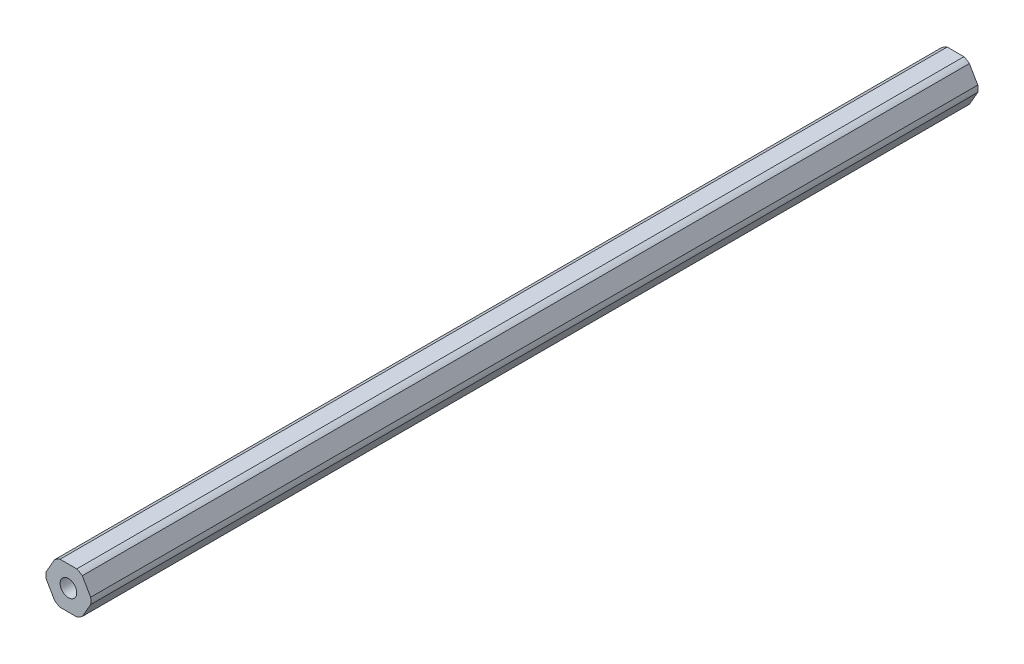
ISO-10303-21;
HEADER;
FILE_DESCRIPTION(('STEP AP214'),'2;1');
FILE_NAME('part.step','',(''),(''),'','','');
FILE_SCHEMA(('AUTOMOTIVE_DESIGN { 1 0 10303 214 1 1 1 1 }'));
ENDSEC;
DATA;
#1=APPLICATION_CONTEXT('core data for automotive mechanical design processes');
#2=APPLICATION_PROTOCOL_DEFINITION('international standard','automotive_design',2000,#1);
#3=PRODUCT_CONTEXT('',#1,'mechanical');
#4=PRODUCT('Part','Part','',(#3));
#5=PRODUCT_RELATED_PRODUCT_CATEGORY('part','',(#4));
#6=PRODUCT_DEFINITION_FORMATION('','',#4);
#7=PRODUCT_DEFINITION_CONTEXT('part definition',#1,'design');
#8=PRODUCT_DEFINITION('design','',#6,#7);
#9=PRODUCT_DEFINITION_SHAPE('','',#8);
#10=(LENGTH_UNIT() NAMED_UNIT(*) SI_UNIT(.MILLI.,.METRE.));
#11=(NAMED_UNIT(*) PLANE_ANGLE_UNIT() SI_UNIT($,.RADIAN.));
#12=(NAMED_UNIT(*) SI_UNIT($,.STERADIAN.) SOLID_ANGLE_UNIT());
#13=UNCERTAINTY_MEASURE_WITH_UNIT(LENGTH_MEASURE(1.E-05),#10,'distance_accuracy_value','');
#14=(GEOMETRIC_REPRESENTATION_CONTEXT(3) GLOBAL_UNCERTAINTY_ASSIGNED_CONTEXT((#13)) GLOBAL_UNIT_ASSIGNED_CONTEXT((#10,
#11,#12)) REPRESENTATION_CONTEXT('',''));
#15=CARTESIAN_POINT('',(0.,0.,0.));
#16=DIRECTION('',(0.,0.,1.));
#17=DIRECTION('',(1.,0.,0.));
#18=AXIS2_PLACEMENT_3D('',#15,#16,#17);
#19=CARTESIAN_POINT('',(3.68083890619154,-6.3754,228.6));
#20=DIRECTION('',(-0.866025403784439,0.5,0.));
#21=DIRECTION('',(0.,0.,1.));
#22=AXIS2_PLACEMENT_3D('',#19,#20,#21);
#23=PLANE('',#22);
#24=DIRECTION('',(0.,0.,-1.));
#25=VECTOR('',#24,1.);
#26=CARTESIAN_POINT('',(6.80102150534208,-0.971085209378962,-228.6));
#27=LINE('',#26,#25);
#28=CARTESIAN_POINT('',(6.80102150534208,-0.971085209378956,42.9133));
#29=VERTEX_POINT('',#28);
#30=CARTESIAN_POINT('',(6.80102150534208,-0.971085209378955,-228.6));
#31=VERTEX_POINT('',#30);
#32=EDGE_CURVE('E176',#29,#31,#27,.T.);
#33=ORIENTED_EDGE('',*,*,#32,.F.);
#34=DIRECTION('',(0.500000000000001,0.866025403784438,0.));
#35=VECTOR('',#34,1.);
#36=CARTESIAN_POINT('',(5.52125835928731,-3.18770000000001,42.9133));
#37=LINE('',#36,#35);
#38=CARTESIAN_POINT('',(4.24149521323254,-5.40431479062105,42.9133));
#39=VERTEX_POINT('',#38);
#40=EDGE_CURVE('E179',#39,#29,#37,.T.);
#41=ORIENTED_EDGE('',*,*,#40,.F.);
#42=DIRECTION('',(0.,0.,1.));
#43=VECTOR('',#42,1.);
#44=CARTESIAN_POINT('',(4.24149521323255,-5.40431479062104,-228.6));
#45=LINE('',#44,#43);
#46=CARTESIAN_POINT('',(4.24149521323254,-5.40431479062105,-228.6));
#47=VERTEX_POINT('',#46);
#48=EDGE_CURVE('E277',#47,#39,#45,.T.);
#49=ORIENTED_EDGE('',*,*,#48,.F.);
#50=DIRECTION('',(0.5,0.866025403784439,0.));
#51=VECTOR('',#50,1.);
#52=CARTESIAN_POINT('',(3.68083890619154,-6.3754,-228.6));
#53=LINE('',#52,#51);
#54=EDGE_CURVE('E181',#47,#31,#53,.T.);
#55=ORIENTED_EDGE('',*,*,#54,.T.);
#56=EDGE_LOOP('',(#33,#41,#49,#55));
#57=FACE_BOUND('',#56,.T.);
#58=ADVANCED_FACE('F45',(#57),#23,.F.);
#59=CARTESIAN_POINT('',(7.36167781238308,0.,228.6));
#60=DIRECTION('',(-0.866025403784439,-0.5,0.));
#61=DIRECTION('',(-0.5,0.866025403784439,0.));
#62=AXIS2_PLACEMENT_3D('',#59,#60,#61);
#63=PLANE('',#62);
#64=DIRECTION('',(0.,0.,-1.));
#65=VECTOR('',#64,1.);
#66=CARTESIAN_POINT('',(4.24149521323254,5.40431479062105,-228.6));
#67=LINE('',#66,#65);
#68=CARTESIAN_POINT('',(4.24149521323254,5.40431479062105,42.9133));
#69=VERTEX_POINT('',#68);
#70=CARTESIAN_POINT('',(4.24149521323254,5.40431479062105,-228.6));
#71=VERTEX_POINT('',#70);
#72=EDGE_CURVE('E263',#69,#71,#67,.T.);
#73=ORIENTED_EDGE('',*,*,#72,.F.);
#74=DIRECTION('',(-0.5,0.866025403784438,0.));
#75=VECTOR('',#74,1.);
#76=CARTESIAN_POINT('',(5.52125835928731,3.1877,42.9133));
#77=LINE('',#76,#75);
#78=CARTESIAN_POINT('',(6.80102150534208,0.97108520937895,42.9133));
#79=VERTEX_POINT('',#78);
#80=EDGE_CURVE('E197',#79,#69,#77,.T.);
#81=ORIENTED_EDGE('',*,*,#80,.F.);
#82=DIRECTION('',(0.,0.,1.));
#83=VECTOR('',#82,1.);
#84=CARTESIAN_POINT('',(6.80102150534208,0.971085209378949,-228.6));
#85=LINE('',#84,#83);
#86=CARTESIAN_POINT('',(6.80102150534208,0.97108520937895,-228.6));
#87=VERTEX_POINT('',#86);
#88=EDGE_CURVE('E192',#87,#79,#85,.T.);
#89=ORIENTED_EDGE('',*,*,#88,.F.);
#90=DIRECTION('',(-0.5,0.866025403784439,0.));
#91=VECTOR('',#90,1.);
#92=CARTESIAN_POINT('',(7.36167781238308,0.,-228.6));
#93=LINE('',#92,#91);
#94=EDGE_CURVE('E284',#87,#71,#93,.T.);
#95=ORIENTED_EDGE('',*,*,#94,.T.);
#96=EDGE_LOOP('',(#73,#81,#89,#95));
#97=FACE_BOUND('',#96,.T.);
#98=ADVANCED_FACE('F341',(#97),#63,.F.);
#99=CARTESIAN_POINT('',(3.68083890619154,6.3754,228.6));
#100=DIRECTION('',(0.,-1.,0.));
#101=DIRECTION('',(0.,0.,-1.));
#102=AXIS2_PLACEMENT_3D('',#99,#100,#101);
#103=PLANE('',#102);
#104=DIRECTION('',(0.,0.,-1.));
#105=VECTOR('',#104,1.);
#106=CARTESIAN_POINT('',(-2.55952629210953,6.3754,-228.6));
#107=LINE('',#106,#105);
#108=CARTESIAN_POINT('',(-2.55952629210953,6.3754,42.9133));
#109=VERTEX_POINT('',#108);
#110=CARTESIAN_POINT('',(-2.55952629210953,6.3754,-228.6));
#111=VERTEX_POINT('',#110);
#112=EDGE_CURVE('E104',#109,#111,#107,.T.);
#113=ORIENTED_EDGE('',*,*,#112,.F.);
#114=DIRECTION('',(-1.,0.,0.));
#115=VECTOR('',#114,1.);
#116=CARTESIAN_POINT('',(0.,6.3754,42.9133));
#117=LINE('',#116,#115);
#118=CARTESIAN_POINT('',(2.55952629210953,6.3754,42.9133));
#119=VERTEX_POINT('',#118);
#120=EDGE_CURVE('E217',#119,#109,#117,.T.);
#121=ORIENTED_EDGE('',*,*,#120,.F.);
#122=DIRECTION('',(0.,0.,1.));
#123=VECTOR('',#122,1.);
#124=CARTESIAN_POINT('',(2.55952629210952,6.3754,-228.6));
#125=LINE('',#124,#123);
#126=CARTESIAN_POINT('',(2.55952629210952,6.3754,-228.6));
#127=VERTEX_POINT('',#126);
#128=EDGE_CURVE('E90',#127,#119,#125,.T.);
#129=ORIENTED_EDGE('',*,*,#128,.F.);
#130=DIRECTION('',(-1.,0.,0.));
#131=VECTOR('',#130,1.);
#132=CARTESIAN_POINT('',(3.68083890619154,6.3754,-228.6));
#133=LINE('',#132,#131);
#134=EDGE_CURVE('E281',#127,#111,#133,.T.);
#135=ORIENTED_EDGE('',*,*,#134,.T.);
#136=EDGE_LOOP('',(#113,#121,#129,#135));
#137=FACE_BOUND('',#136,.T.);
#138=ADVANCED_FACE('F363',(#137),#103,.F.);
#139=CARTESIAN_POINT('',(-3.68083890619154,6.3754,228.6));
#140=DIRECTION('',(0.866025403784439,-0.5,0.));
#141=DIRECTION('',(0.,0.,-1.));
#142=AXIS2_PLACEMENT_3D('',#139,#140,#141);
#143=PLANE('',#142);
#144=DIRECTION('',(0.,0.,-1.));
#145=VECTOR('',#144,1.);
#146=CARTESIAN_POINT('',(-6.80102150534208,0.97108520937896,-228.6));
#147=LINE('',#146,#145);
#148=CARTESIAN_POINT('',(-6.80102150534208,0.971085209378959,42.9133));
#149=VERTEX_POINT('',#148);
#150=CARTESIAN_POINT('',(-6.80102150534208,0.97108520937896,-228.6));
#151=VERTEX_POINT('',#150);
#152=EDGE_CURVE('E257',#149,#151,#147,.T.);
#153=ORIENTED_EDGE('',*,*,#152,.F.);
#154=DIRECTION('',(-0.500000000000001,-0.866025403784438,0.));
#155=VECTOR('',#154,1.);
#156=CARTESIAN_POINT('',(-5.52125835928731,3.18770000000001,42.9133));
#157=LINE('',#156,#155);
#158=CARTESIAN_POINT('',(-4.24149521323255,5.40431479062104,42.9133));
#159=VERTEX_POINT('',#158);
#160=EDGE_CURVE('E225',#159,#149,#157,.T.);
#161=ORIENTED_EDGE('',*,*,#160,.F.);
#162=DIRECTION('',(0.,0.,1.));
#163=VECTOR('',#162,1.);
#164=CARTESIAN_POINT('',(-4.24149521323255,5.40431479062105,-228.6));
#165=LINE('',#164,#163);
#166=CARTESIAN_POINT('',(-4.24149521323255,5.40431479062105,-228.6));
#167=VERTEX_POINT('',#166);
#168=EDGE_CURVE('E264',#167,#159,#165,.T.);
#169=ORIENTED_EDGE('',*,*,#168,.F.);
#170=DIRECTION('',(-0.5,-0.866025403784439,0.));
#171=VECTOR('',#170,1.);
#172=CARTESIAN_POINT('',(-3.68083890619154,6.3754,-228.6));
#173=LINE('',#172,#171);
#174=EDGE_CURVE('E251',#167,#151,#173,.T.);
#175=ORIENTED_EDGE('',*,*,#174,.T.);
#176=EDGE_LOOP('',(#153,#161,#169,#175));
#177=FACE_BOUND('',#176,.T.);
#178=ADVANCED_FACE('F375',(#177),#143,.F.);
#179=CARTESIAN_POINT('',(-7.36167781238308,0.,228.6));
#180=DIRECTION('',(0.866025403784439,0.5,0.));
#181=DIRECTION('',(0.,0.,-1.));
#182=AXIS2_PLACEMENT_3D('',#179,#180,#181);
#183=PLANE('',#182);
#184=DIRECTION('',(0.,0.,-1.));
#185=VECTOR('',#184,1.);
#186=CARTESIAN_POINT('',(-4.24149521323255,-5.40431479062104,-228.6));
#187=LINE('',#186,#185);
#188=CARTESIAN_POINT('',(-4.24149521323255,-5.40431479062105,42.9133));
#189=VERTEX_POINT('',#188);
#190=CARTESIAN_POINT('',(-4.24149521323254,-5.40431479062105,-228.6));
#191=VERTEX_POINT('',#190);
#192=EDGE_CURVE('E273',#189,#191,#187,.T.);
#193=ORIENTED_EDGE('',*,*,#192,.F.);
#194=DIRECTION('',(0.5,-0.866025403784439,0.));
#195=VECTOR('',#194,1.);
#196=CARTESIAN_POINT('',(-5.52125835928731,-3.1877,42.9133));
#197=LINE('',#196,#195);
#198=CARTESIAN_POINT('',(-6.80102150534208,-0.971085209378948,42.9133));
#199=VERTEX_POINT('',#198);
#200=EDGE_CURVE('E233',#199,#189,#197,.T.);
#201=ORIENTED_EDGE('',*,*,#200,.F.);
#202=DIRECTION('',(0.,0.,1.));
#203=VECTOR('',#202,1.);
#204=CARTESIAN_POINT('',(-6.80102150534208,-0.971085209378962,-228.6));
#205=LINE('',#204,#203);
#206=CARTESIAN_POINT('',(-6.80102150534208,-0.971085209378956,-228.6));
#207=VERTEX_POINT('',#206);
#208=EDGE_CURVE('E258',#207,#199,#205,.T.);
#209=ORIENTED_EDGE('',*,*,#208,.F.);
#210=DIRECTION('',(0.5,-0.866025403784439,0.));
#211=VECTOR('',#210,1.);
#212=CARTESIAN_POINT('',(-7.36167781238308,0.,-228.6));
#213=LINE('',#212,#211);
#214=EDGE_CURVE('E247',#207,#191,#213,.T.);
#215=ORIENTED_EDGE('',*,*,#214,.T.);
#216=EDGE_LOOP('',(#193,#201,#209,#215));
#217=FACE_BOUND('',#216,.T.);
#218=ADVANCED_FACE('F373',(#217),#183,.F.);
#219=CARTESIAN_POINT('',(-3.68083890619154,-6.3754,228.6));
#220=DIRECTION('',(0.,1.,0.));
#221=DIRECTION('',(1.,0.,0.));
#222=AXIS2_PLACEMENT_3D('',#219,#220,#221);
#223=PLANE('',#222);
#224=DIRECTION('',(0.,0.,-1.));
#225=VECTOR('',#224,1.);
#226=CARTESIAN_POINT('',(2.55952629210953,-6.3754,-228.6));
#227=LINE('',#226,#225);
#228=CARTESIAN_POINT('',(2.55952629210953,-6.3754,42.9133));
#229=VERTEX_POINT('',#228);
#230=CARTESIAN_POINT('',(2.55952629210953,-6.3754,-228.6));
#231=VERTEX_POINT('',#230);
#232=EDGE_CURVE('E272',#229,#231,#227,.T.);
#233=ORIENTED_EDGE('',*,*,#232,.F.);
#234=DIRECTION('',(1.,0.,0.));
#235=VECTOR('',#234,1.);
#236=CARTESIAN_POINT('',(0.,-6.3754,42.9133));
#237=LINE('',#236,#235);
#238=CARTESIAN_POINT('',(-2.55952629210953,-6.3754,42.9133));
#239=VERTEX_POINT('',#238);
#240=EDGE_CURVE('E241',#239,#229,#237,.T.);
#241=ORIENTED_EDGE('',*,*,#240,.F.);
#242=DIRECTION('',(0.,0.,1.));
#243=VECTOR('',#242,1.);
#244=CARTESIAN_POINT('',(-2.55952629210953,-6.3754,-228.6));
#245=LINE('',#244,#243);
#246=CARTESIAN_POINT('',(-2.55952629210953,-6.3754,-228.6));
#247=VERTEX_POINT('',#246);
#248=EDGE_CURVE('E287',#247,#239,#245,.T.);
#249=ORIENTED_EDGE('',*,*,#248,.F.);
#250=DIRECTION('',(1.,0.,0.));
#251=VECTOR('',#250,1.);
#252=CARTESIAN_POINT('',(-3.68083890619154,-6.3754,-228.6));
#253=LINE('',#252,#251);
#254=EDGE_CURVE('E252',#247,#231,#253,.T.);
#255=ORIENTED_EDGE('',*,*,#254,.T.);
#256=EDGE_LOOP('',(#233,#241,#249,#255));
#257=FACE_BOUND('',#256,.T.);
#258=ADVANCED_FACE('F372',(#257),#223,.F.);
#259=CARTESIAN_POINT('',(0.,0.,-228.6));
#260=DIRECTION('',(0.,0.,1.));
#261=DIRECTION('',(1.,0.,0.));
#262=AXIS2_PLACEMENT_3D('',#259,#260,#261);
#263=CYLINDRICAL_SURFACE('',#262,6.87);
#264=ORIENTED_EDGE('',*,*,#88,.T.);
#265=CARTESIAN_POINT('',(0.,0.,42.9133));
#266=DIRECTION('',(0.,0.,1.));
#267=DIRECTION('',(1.,0.,0.));
#268=AXIS2_PLACEMENT_3D('',#265,#266,#267);
#269=CIRCLE('',#268,6.87);
#270=EDGE_CURVE('E189',#29,#79,#269,.T.);
#271=ORIENTED_EDGE('',*,*,#270,.F.);
#272=ORIENTED_EDGE('',*,*,#32,.T.);
#273=CARTESIAN_POINT('',(0.,0.,-228.6));
#274=DIRECTION('',(0.,0.,1.));
#275=DIRECTION('',(1.,0.,0.));
#276=AXIS2_PLACEMENT_3D('',#273,#274,#275);
#277=CIRCLE('',#276,6.87);
#278=CARTESIAN_POINT('',(6.87,0.,-228.6));
#279=VERTEX_POINT('',#278);
#280=EDGE_CURVE('E55',#31,#279,#277,.T.);
#281=ORIENTED_EDGE('',*,*,#280,.T.);
#282=DIRECTION('',(0.,0.,1.));
#283=VECTOR('',#282,1.);
#284=CARTESIAN_POINT('',(6.87,0.,-228.6));
#285=LINE('',#284,#283);
#286=CARTESIAN_POINT('',(6.87,0.,-144.04975));
#287=VERTEX_POINT('',#286);
#288=EDGE_CURVE('E186',#279,#287,#285,.T.);
#289=ORIENTED_EDGE('',*,*,#288,.T.);
#290=ORIENTED_EDGE('',*,*,#288,.F.);
#291=CARTESIAN_POINT('',(0.,0.,-228.6));
#292=DIRECTION('',(0.,0.,1.));
#293=DIRECTION('',(1.,0.,0.));
#294=AXIS2_PLACEMENT_3D('',#291,#292,#293);
#295=CIRCLE('',#294,6.87);
#296=EDGE_CURVE('E276',#279,#87,#295,.T.);
#297=ORIENTED_EDGE('',*,*,#296,.T.);
#298=EDGE_LOOP('',(#264,#271,#272,#281,#289,#290,#297));
#299=FACE_BOUND('',#298,.T.);
#300=ADVANCED_FACE('F190',(#299),#263,.T.);
#301=CARTESIAN_POINT('',(0.,0.,-228.6));
#302=DIRECTION('',(0.,0.,1.));
#303=DIRECTION('',(1.,0.,0.));
#304=AXIS2_PLACEMENT_3D('',#301,#302,#303);
#305=CYLINDRICAL_SURFACE('',#304,6.87);
#306=ORIENTED_EDGE('',*,*,#48,.T.);
#307=CARTESIAN_POINT('',(0.,0.,42.9133));
#308=DIRECTION('',(0.,0.,1.));
#309=DIRECTION('',(1.,0.,0.));
#310=AXIS2_PLACEMENT_3D('',#307,#308,#309);
#311=CIRCLE('',#310,6.87);
#312=EDGE_CURVE('E203',#229,#39,#311,.T.);
#313=ORIENTED_EDGE('',*,*,#312,.F.);
#314=ORIENTED_EDGE('',*,*,#232,.T.);
#315=CARTESIAN_POINT('',(0.,0.,-228.6));
#316=DIRECTION('',(0.,0.,1.));
#317=DIRECTION('',(1.,0.,0.));
#318=AXIS2_PLACEMENT_3D('',#315,#316,#317);
#319=CIRCLE('',#318,6.87);
#320=EDGE_CURVE('E268',#231,#47,#319,.T.);
#321=ORIENTED_EDGE('',*,*,#320,.T.);
#322=EDGE_LOOP('',(#306,#313,#314,#321));
#323=FACE_BOUND('',#322,.T.);
#324=ADVANCED_FACE('F371',(#323),#305,.T.);
#325=CARTESIAN_POINT('',(0.,0.,-228.6));
#326=DIRECTION('',(0.,0.,1.));
#327=DIRECTION('',(1.,0.,0.));
#328=AXIS2_PLACEMENT_3D('',#325,#326,#327);
#329=CYLINDRICAL_SURFACE('',#328,6.87);
#330=ORIENTED_EDGE('',*,*,#248,.T.);
#331=CARTESIAN_POINT('',(0.,0.,42.9133));
#332=DIRECTION('',(0.,0.,1.));
#333=DIRECTION('',(1.,0.,0.));
#334=AXIS2_PLACEMENT_3D('',#331,#332,#333);
#335=CIRCLE('',#334,6.87);
#336=EDGE_CURVE('E237',#189,#239,#335,.T.);
#337=ORIENTED_EDGE('',*,*,#336,.F.);
#338=ORIENTED_EDGE('',*,*,#192,.T.);
#339=CARTESIAN_POINT('',(0.,0.,-228.6));
#340=DIRECTION('',(0.,0.,1.));
#341=DIRECTION('',(1.,0.,0.));
#342=AXIS2_PLACEMENT_3D('',#339,#340,#341);
#343=CIRCLE('',#342,6.87);
#344=EDGE_CURVE('E292',#191,#247,#343,.T.);
#345=ORIENTED_EDGE('',*,*,#344,.T.);
#346=EDGE_LOOP('',(#330,#337,#338,#345));
#347=FACE_BOUND('',#346,.T.);
#348=ADVANCED_FACE('F366',(#347),#329,.T.);
#349=CARTESIAN_POINT('',(0.,0.,-228.6));
#350=DIRECTION('',(0.,0.,1.));
#351=DIRECTION('',(1.,0.,0.));
#352=AXIS2_PLACEMENT_3D('',#349,#350,#351);
#353=CYLINDRICAL_SURFACE('',#352,6.87);
#354=ORIENTED_EDGE('',*,*,#208,.T.);
#355=CARTESIAN_POINT('',(0.,0.,42.9133));
#356=DIRECTION('',(0.,0.,1.));
#357=DIRECTION('',(1.,0.,0.));
#358=AXIS2_PLACEMENT_3D('',#355,#356,#357);
#359=CIRCLE('',#358,6.87);
#360=EDGE_CURVE('E229',#149,#199,#359,.T.);
#361=ORIENTED_EDGE('',*,*,#360,.F.);
#362=ORIENTED_EDGE('',*,*,#152,.T.);
#363=CARTESIAN_POINT('',(0.,0.,-228.6));
#364=DIRECTION('',(0.,0.,1.));
#365=DIRECTION('',(1.,0.,0.));
#366=AXIS2_PLACEMENT_3D('',#363,#364,#365);
#367=CIRCLE('',#366,6.87);
#368=EDGE_CURVE('E253',#151,#207,#367,.T.);
#369=ORIENTED_EDGE('',*,*,#368,.T.);
#370=EDGE_LOOP('',(#354,#361,#362,#369));
#371=FACE_BOUND('',#370,.T.);
#372=ADVANCED_FACE('F354',(#371),#353,.T.);
#373=CARTESIAN_POINT('',(0.,0.,-228.6));
#374=DIRECTION('',(0.,0.,1.));
#375=DIRECTION('',(1.,0.,0.));
#376=AXIS2_PLACEMENT_3D('',#373,#374,#375);
#377=CYLINDRICAL_SURFACE('',#376,6.87);
#378=ORIENTED_EDGE('',*,*,#168,.T.);
#379=CARTESIAN_POINT('',(0.,0.,42.9133));
#380=DIRECTION('',(0.,0.,1.));
#381=DIRECTION('',(1.,0.,0.));
#382=AXIS2_PLACEMENT_3D('',#379,#380,#381);
#383=CIRCLE('',#382,6.87);
#384=EDGE_CURVE('E221',#109,#159,#383,.T.);
#385=ORIENTED_EDGE('',*,*,#384,.F.);
#386=ORIENTED_EDGE('',*,*,#112,.T.);
#387=CARTESIAN_POINT('',(0.,0.,-228.6));
#388=DIRECTION('',(0.,0.,1.));
#389=DIRECTION('',(1.,0.,0.));
#390=AXIS2_PLACEMENT_3D('',#387,#388,#389);
#391=CIRCLE('',#390,6.87);
#392=EDGE_CURVE('E267',#111,#167,#391,.T.);
#393=ORIENTED_EDGE('',*,*,#392,.T.);
#394=EDGE_LOOP('',(#378,#385,#386,#393));
#395=FACE_BOUND('',#394,.T.);
#396=ADVANCED_FACE('F347',(#395),#377,.T.);
#397=CARTESIAN_POINT('',(0.,0.,-228.6));
#398=DIRECTION('',(0.,0.,1.));
#399=DIRECTION('',(1.,0.,0.));
#400=AXIS2_PLACEMENT_3D('',#397,#398,#399);
#401=CYLINDRICAL_SURFACE('',#400,6.87);
#402=ORIENTED_EDGE('',*,*,#128,.T.);
#403=CARTESIAN_POINT('',(0.,0.,42.9133));
#404=DIRECTION('',(0.,0.,1.));
#405=DIRECTION('',(1.,0.,0.));
#406=AXIS2_PLACEMENT_3D('',#403,#404,#405);
#407=CIRCLE('',#406,6.87);
#408=EDGE_CURVE('E213',#69,#119,#407,.T.);
#409=ORIENTED_EDGE('',*,*,#408,.F.);
#410=ORIENTED_EDGE('',*,*,#72,.T.);
#411=CARTESIAN_POINT('',(0.,0.,-228.6));
#412=DIRECTION('',(0.,0.,1.));
#413=DIRECTION('',(1.,0.,0.));
#414=AXIS2_PLACEMENT_3D('',#411,#412,#413);
#415=CIRCLE('',#414,6.87);
#416=EDGE_CURVE('E259',#71,#127,#415,.T.);
#417=ORIENTED_EDGE('',*,*,#416,.T.);
#418=EDGE_LOOP('',(#402,#409,#410,#417));
#419=FACE_BOUND('',#418,.T.);
#420=ADVANCED_FACE('F344',(#419),#401,.T.);
#421=CARTESIAN_POINT('',(0.,0.,-228.6));
#422=DIRECTION('',(0.,0.,1.));
#423=DIRECTION('',(1.,0.,0.));
#424=AXIS2_PLACEMENT_3D('',#421,#422,#423);
#425=CYLINDRICAL_SURFACE('',#424,2.55);
#426=DIRECTION('',(0.,0.,1.));
#427=VECTOR('',#426,1.);
#428=CARTESIAN_POINT('',(2.55,0.,-228.6));
#429=LINE('',#428,#427);
#430=CARTESIAN_POINT('',(2.55,0.,-228.6));
#431=VERTEX_POINT('',#430);
#432=CARTESIAN_POINT('',(2.55,0.,-144.04975));
#433=VERTEX_POINT('',#432);
#434=EDGE_CURVE('E246',#431,#433,#429,.T.);
#435=ORIENTED_EDGE('',*,*,#434,.T.);
#436=ORIENTED_EDGE('',*,*,#434,.F.);
#437=CARTESIAN_POINT('',(0.,0.,-228.6));
#438=DIRECTION('',(0.,0.,1.));
#439=DIRECTION('',(1.,0.,0.));
#440=AXIS2_PLACEMENT_3D('',#437,#438,#439);
#441=CIRCLE('',#440,2.55);
#442=CARTESIAN_POINT('',(-2.55,0.,-228.6));
#443=VERTEX_POINT('',#442);
#444=EDGE_CURVE('E69',#443,#431,#441,.T.);
#445=ORIENTED_EDGE('',*,*,#444,.F.);
#446=DIRECTION('',(0.,0.,1.));
#447=VECTOR('',#446,1.);
#448=CARTESIAN_POINT('',(-2.55,0.,-228.6));
#449=LINE('',#448,#447);
#450=CARTESIAN_POINT('',(-2.55,0.,-144.04975));
#451=VERTEX_POINT('',#450);
#452=EDGE_CURVE('E11',#443,#451,#449,.T.);
#453=ORIENTED_EDGE('',*,*,#452,.T.);
#454=ORIENTED_EDGE('',*,*,#452,.F.);
#455=CARTESIAN_POINT('',(0.,0.,-228.6));
#456=DIRECTION('',(0.,0.,1.));
#457=DIRECTION('',(1.,0.,0.));
#458=AXIS2_PLACEMENT_3D('',#455,#456,#457);
#459=CIRCLE('',#458,2.55);
#460=EDGE_CURVE('E280',#431,#443,#459,.T.);
#461=ORIENTED_EDGE('',*,*,#460,.F.);
#462=EDGE_LOOP('',(#435,#436,#445,#453,#454,#461));
#463=FACE_BOUND('',#462,.T.);
#464=CARTESIAN_POINT('',(0.,0.,42.9133));
#465=DIRECTION('',(0.,0.,1.));
#466=DIRECTION('',(1.,0.,0.));
#467=AXIS2_PLACEMENT_3D('',#464,#465,#466);
#468=CIRCLE('',#467,2.55);
#469=CARTESIAN_POINT('',(2.55,0.,42.9133));
#470=VERTEX_POINT('',#469);
#471=EDGE_CURVE('E205',#470,#470,#468,.F.);
#472=ORIENTED_EDGE('',*,*,#471,.F.);
#473=EDGE_LOOP('',(#472));
#474=FACE_BOUND('',#473,.T.);
#475=ADVANCED_FACE('F346',(#463,#474),#425,.F.);
#476=CARTESIAN_POINT('',(0.,0.,-228.6));
#477=DIRECTION('',(0.,0.,1.));
#478=DIRECTION('',(1.,0.,0.));
#479=AXIS2_PLACEMENT_3D('',#476,#477,#478);
#480=PLANE('',#479);
#481=ORIENTED_EDGE('',*,*,#416,.F.);
#482=ORIENTED_EDGE('',*,*,#94,.F.);
#483=ORIENTED_EDGE('',*,*,#296,.F.);
#484=ORIENTED_EDGE('',*,*,#280,.F.);
#485=ORIENTED_EDGE('',*,*,#54,.F.);
#486=ORIENTED_EDGE('',*,*,#320,.F.);
#487=ORIENTED_EDGE('',*,*,#254,.F.);
#488=ORIENTED_EDGE('',*,*,#344,.F.);
#489=ORIENTED_EDGE('',*,*,#214,.F.);
#490=ORIENTED_EDGE('',*,*,#368,.F.);
#491=ORIENTED_EDGE('',*,*,#174,.F.);
#492=ORIENTED_EDGE('',*,*,#392,.F.);
#493=ORIENTED_EDGE('',*,*,#134,.F.);
#494=EDGE_LOOP('',(#481,#482,#483,#484,#485,#486,#487,#488,#489,#490,#491,#492,#493));
#495=FACE_BOUND('',#494,.T.);
#496=ORIENTED_EDGE('',*,*,#460,.T.);
#497=ORIENTED_EDGE('',*,*,#444,.T.);
#498=EDGE_LOOP('',(#496,#497));
#499=FACE_BOUND('',#498,.T.);
#500=ADVANCED_FACE('F47',(#495,#499),#480,.F.);
#501=CARTESIAN_POINT('',(0.,0.,42.9133));
#502=DIRECTION('',(0.,0.,1.));
#503=DIRECTION('',(1.,0.,0.));
#504=AXIS2_PLACEMENT_3D('',#501,#502,#503);
#505=PLANE('',#504);
#506=ORIENTED_EDGE('',*,*,#471,.T.);
#507=EDGE_LOOP('',(#506));
#508=FACE_BOUND('',#507,.T.);
#509=ORIENTED_EDGE('',*,*,#40,.T.);
#510=ORIENTED_EDGE('',*,*,#270,.T.);
#511=ORIENTED_EDGE('',*,*,#80,.T.);
#512=ORIENTED_EDGE('',*,*,#408,.T.);
#513=ORIENTED_EDGE('',*,*,#120,.T.);
#514=ORIENTED_EDGE('',*,*,#384,.T.);
#515=ORIENTED_EDGE('',*,*,#160,.T.);
#516=ORIENTED_EDGE('',*,*,#360,.T.);
#517=ORIENTED_EDGE('',*,*,#200,.T.);
#518=ORIENTED_EDGE('',*,*,#336,.T.);
#519=ORIENTED_EDGE('',*,*,#240,.T.);
#520=ORIENTED_EDGE('',*,*,#312,.T.);
#521=EDGE_LOOP('',(#509,#510,#511,#512,#513,#514,#515,#516,#517,#518,#519,#520));
#522=FACE_BOUND('',#521,.T.);
#523=ADVANCED_FACE('F200',(#508,#522),#505,.T.);
#524=CLOSED_SHELL('',(#58,#98,#138,#178,#218,#258,#300,#324,#348,#372,#396,#420,#475,#500,#523));
#525=MANIFOLD_SOLID_BREP('B2',#524);
#526=ADVANCED_BREP_SHAPE_REPRESENTATION('',(#18,#525),#14);
#527=SHAPE_DEFINITION_REPRESENTATION(#9,#526);
ENDSEC;
END-ISO-10303-21;
